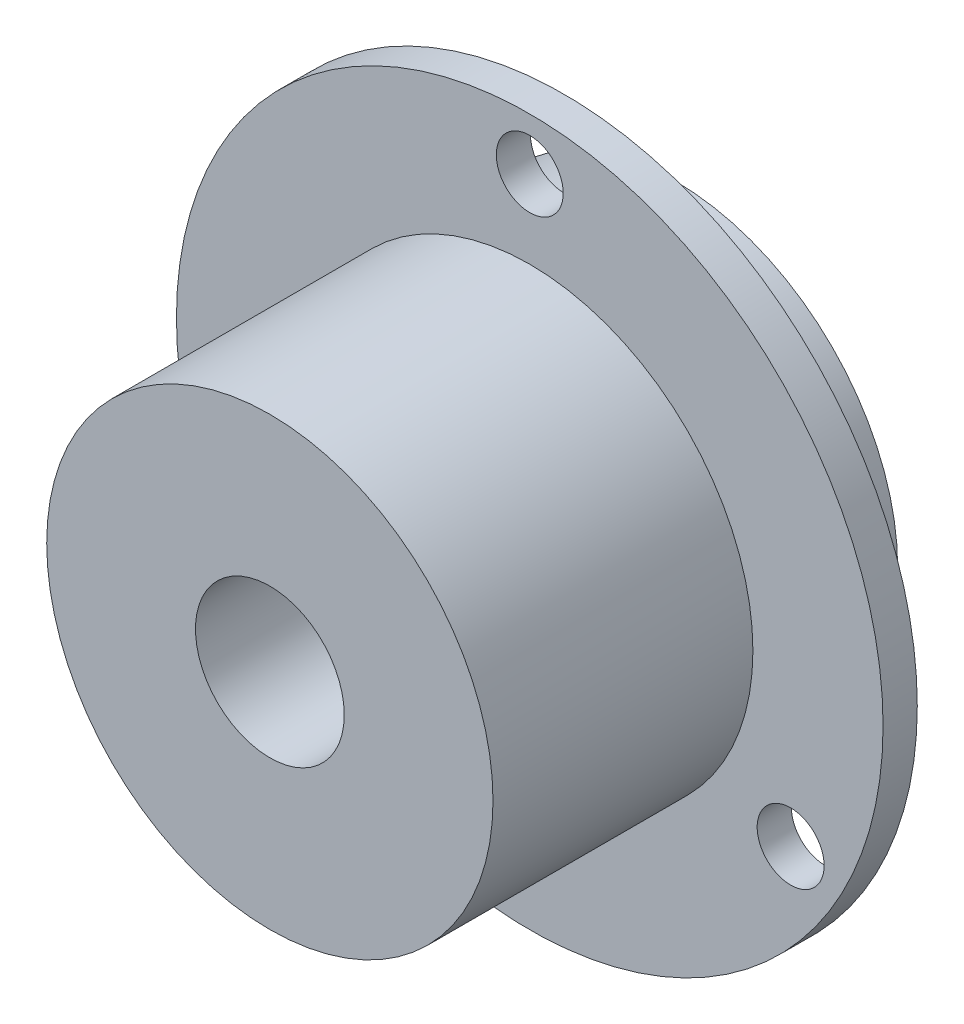
ISO-10303-21;
HEADER;
FILE_DESCRIPTION(('STEP AP214'),'2;1');
FILE_NAME('part.step','',(''),(''),'','','');
FILE_SCHEMA(('AUTOMOTIVE_DESIGN { 1 0 10303 214 1 1 1 1 }'));
ENDSEC;
DATA;
#1=APPLICATION_CONTEXT('core data for automotive mechanical design processes');
#2=APPLICATION_PROTOCOL_DEFINITION('international standard','automotive_design',2000,#1);
#3=PRODUCT_CONTEXT('',#1,'mechanical');
#4=PRODUCT('Part','Part','',(#3));
#5=PRODUCT_RELATED_PRODUCT_CATEGORY('part','',(#4));
#6=PRODUCT_DEFINITION_FORMATION('','',#4);
#7=PRODUCT_DEFINITION_CONTEXT('part definition',#1,'design');
#8=PRODUCT_DEFINITION('design','',#6,#7);
#9=PRODUCT_DEFINITION_SHAPE('','',#8);
#10=(LENGTH_UNIT() NAMED_UNIT(*) SI_UNIT(.MILLI.,.METRE.));
#11=(NAMED_UNIT(*) PLANE_ANGLE_UNIT() SI_UNIT($,.RADIAN.));
#12=(NAMED_UNIT(*) SI_UNIT($,.STERADIAN.) SOLID_ANGLE_UNIT());
#13=UNCERTAINTY_MEASURE_WITH_UNIT(LENGTH_MEASURE(1.E-05),#10,'distance_accuracy_value','');
#14=(GEOMETRIC_REPRESENTATION_CONTEXT(3) GLOBAL_UNCERTAINTY_ASSIGNED_CONTEXT((#13)) GLOBAL_UNIT_ASSIGNED_CONTEXT((#10,
#11,#12)) REPRESENTATION_CONTEXT('',''));
#15=CARTESIAN_POINT('',(0.,0.,0.));
#16=DIRECTION('',(0.,0.,1.));
#17=DIRECTION('',(1.,0.,0.));
#18=AXIS2_PLACEMENT_3D('',#15,#16,#17);
#19=CARTESIAN_POINT('',(15.,0.,17.47));
#20=DIRECTION('',(0.,0.,1.));
#21=DIRECTION('',(1.,0.,0.));
#22=AXIS2_PLACEMENT_3D('',#19,#20,#21);
#23=PLANE('',#22);
#24=CARTESIAN_POINT('',(0.,0.,17.47));
#25=DIRECTION('',(0.,0.,1.));
#26=DIRECTION('',(1.,0.,0.));
#27=AXIS2_PLACEMENT_3D('',#24,#25,#26);
#28=CIRCLE('',#27,15.);
#29=CARTESIAN_POINT('',(15.,0.,17.47));
#30=VERTEX_POINT('',#29);
#31=EDGE_CURVE('E66',#30,#30,#28,.T.);
#32=ORIENTED_EDGE('',*,*,#31,.T.);
#33=EDGE_LOOP('',(#32));
#34=FACE_BOUND('',#33,.T.);
#35=CARTESIAN_POINT('',(0.,0.,17.47));
#36=DIRECTION('',(0.,0.,1.));
#37=DIRECTION('',(1.,0.,0.));
#38=AXIS2_PLACEMENT_3D('',#35,#36,#37);
#39=CIRCLE('',#38,4.99999999999999);
#40=CARTESIAN_POINT('',(5.,0.,17.47));
#41=VERTEX_POINT('',#40);
#42=EDGE_CURVE('E10',#41,#41,#39,.T.);
#43=ORIENTED_EDGE('',*,*,#42,.F.);
#44=EDGE_LOOP('',(#43));
#45=FACE_BOUND('',#44,.T.);
#46=ADVANCED_FACE('F32',(#34,#45),#23,.T.);
#47=CARTESIAN_POINT('',(0.,0.,39.2849557522124));
#48=DIRECTION('',(0.,0.,1.));
#49=DIRECTION('',(1.,0.,0.));
#50=AXIS2_PLACEMENT_3D('',#47,#48,#49);
#51=CYLINDRICAL_SURFACE('',#50,4.99999999999999);
#52=ORIENTED_EDGE('',*,*,#42,.T.);
#53=EDGE_LOOP('',(#52));
#54=FACE_BOUND('',#53,.T.);
#55=CARTESIAN_POINT('',(0.,0.,-9.73));
#56=DIRECTION('',(0.,0.,1.));
#57=DIRECTION('',(1.,0.,0.));
#58=AXIS2_PLACEMENT_3D('',#55,#56,#57);
#59=CIRCLE('',#58,4.99999999999999);
#60=CARTESIAN_POINT('',(5.,0.,-9.73));
#61=VERTEX_POINT('',#60);
#62=EDGE_CURVE('E39',#61,#61,#59,.T.);
#63=ORIENTED_EDGE('',*,*,#62,.F.);
#64=EDGE_LOOP('',(#63));
#65=FACE_BOUND('',#64,.T.);
#66=ADVANCED_FACE('F88',(#54,#65),#51,.F.);
#67=CARTESIAN_POINT('',(5.,0.,-9.73));
#68=DIRECTION('',(0.,0.,-1.));
#69=DIRECTION('',(-1.,0.,0.));
#70=AXIS2_PLACEMENT_3D('',#67,#68,#69);
#71=PLANE('',#70);
#72=ORIENTED_EDGE('',*,*,#62,.T.);
#73=EDGE_LOOP('',(#72));
#74=FACE_BOUND('',#73,.T.);
#75=CARTESIAN_POINT('',(0.,0.,-9.73));
#76=DIRECTION('',(0.,0.,1.));
#77=DIRECTION('',(1.,0.,0.));
#78=AXIS2_PLACEMENT_3D('',#75,#76,#77);
#79=CIRCLE('',#78,15.);
#80=CARTESIAN_POINT('',(15.,0.,-9.73));
#81=VERTEX_POINT('',#80);
#82=EDGE_CURVE('E44',#81,#81,#79,.T.);
#83=ORIENTED_EDGE('',*,*,#82,.F.);
#84=EDGE_LOOP('',(#83));
#85=FACE_BOUND('',#84,.T.);
#86=ADVANCED_FACE('F86',(#74,#85),#71,.T.);
#87=CARTESIAN_POINT('',(0.,0.,39.2849557522124));
#88=DIRECTION('',(0.,0.,1.));
#89=DIRECTION('',(1.,0.,0.));
#90=AXIS2_PLACEMENT_3D('',#87,#88,#89);
#91=CYLINDRICAL_SURFACE('',#90,15.);
#92=ORIENTED_EDGE('',*,*,#82,.T.);
#93=EDGE_LOOP('',(#92));
#94=FACE_BOUND('',#93,.T.);
#95=CARTESIAN_POINT('',(0.,0.,-2.3));
#96=DIRECTION('',(0.,0.,1.));
#97=DIRECTION('',(1.,0.,0.));
#98=AXIS2_PLACEMENT_3D('',#95,#96,#97);
#99=CIRCLE('',#98,15.);
#100=CARTESIAN_POINT('',(15.,0.,-2.3));
#101=VERTEX_POINT('',#100);
#102=EDGE_CURVE('E78',#101,#101,#99,.T.);
#103=ORIENTED_EDGE('',*,*,#102,.F.);
#104=EDGE_LOOP('',(#103));
#105=FACE_BOUND('',#104,.T.);
#106=ADVANCED_FACE('F83',(#94,#105),#91,.T.);
#107=CARTESIAN_POINT('',(15.,0.,-2.3));
#108=DIRECTION('',(0.,0.,-1.));
#109=DIRECTION('',(-1.,0.,0.));
#110=AXIS2_PLACEMENT_3D('',#107,#108,#109);
#111=PLANE('',#110);
#112=CARTESIAN_POINT('',(0.,20.25,-2.3));
#113=DIRECTION('',(0.,0.,-1.));
#114=DIRECTION('',(-1.,0.,0.));
#115=AXIS2_PLACEMENT_3D('',#112,#113,#114);
#116=CIRCLE('',#115,2.25);
#117=CARTESIAN_POINT('',(-2.25,20.25,-2.3));
#118=VERTEX_POINT('',#117);
#119=EDGE_CURVE('E63',#118,#118,#116,.T.);
#120=ORIENTED_EDGE('',*,*,#119,.F.);
#121=EDGE_LOOP('',(#120));
#122=FACE_BOUND('',#121,.T.);
#123=CARTESIAN_POINT('',(17.5370144266349,-10.125,-2.3));
#124=DIRECTION('',(0.,0.,-1.));
#125=DIRECTION('',(-1.,0.,0.));
#126=AXIS2_PLACEMENT_3D('',#123,#124,#125);
#127=CIRCLE('',#126,2.25);
#128=CARTESIAN_POINT('',(15.2870144266349,-10.125,-2.3));
#129=VERTEX_POINT('',#128);
#130=EDGE_CURVE('E53',#129,#129,#127,.T.);
#131=ORIENTED_EDGE('',*,*,#130,.F.);
#132=EDGE_LOOP('',(#131));
#133=FACE_BOUND('',#132,.T.);
#134=CARTESIAN_POINT('',(-17.5370144266349,-10.125,-2.3));
#135=DIRECTION('',(0.,0.,-1.));
#136=DIRECTION('',(-1.,0.,0.));
#137=AXIS2_PLACEMENT_3D('',#134,#135,#136);
#138=CIRCLE('',#137,2.25);
#139=CARTESIAN_POINT('',(-19.7870144266349,-10.125,-2.3));
#140=VERTEX_POINT('',#139);
#141=EDGE_CURVE('E50',#140,#140,#138,.T.);
#142=ORIENTED_EDGE('',*,*,#141,.F.);
#143=EDGE_LOOP('',(#142));
#144=FACE_BOUND('',#143,.T.);
#145=ORIENTED_EDGE('',*,*,#102,.T.);
#146=EDGE_LOOP('',(#145));
#147=FACE_BOUND('',#146,.T.);
#148=CARTESIAN_POINT('',(0.,0.,-2.3));
#149=DIRECTION('',(0.,0.,1.));
#150=DIRECTION('',(1.,0.,0.));
#151=AXIS2_PLACEMENT_3D('',#148,#149,#150);
#152=CIRCLE('',#151,23.75);
#153=CARTESIAN_POINT('',(23.75,0.,-2.3));
#154=VERTEX_POINT('',#153);
#155=EDGE_CURVE('E75',#154,#154,#152,.T.);
#156=ORIENTED_EDGE('',*,*,#155,.F.);
#157=EDGE_LOOP('',(#156));
#158=FACE_BOUND('',#157,.T.);
#159=ADVANCED_FACE('F95',(#122,#133,#144,#147,#158),#111,.T.);
#160=CARTESIAN_POINT('',(0.,0.,39.2849557522124));
#161=DIRECTION('',(0.,0.,1.));
#162=DIRECTION('',(1.,0.,0.));
#163=AXIS2_PLACEMENT_3D('',#160,#161,#162);
#164=CYLINDRICAL_SURFACE('',#163,23.75);
#165=ORIENTED_EDGE('',*,*,#155,.T.);
#166=EDGE_LOOP('',(#165));
#167=FACE_BOUND('',#166,.T.);
#168=CARTESIAN_POINT('',(0.,0.,0.));
#169=DIRECTION('',(0.,0.,1.));
#170=DIRECTION('',(1.,0.,0.));
#171=AXIS2_PLACEMENT_3D('',#168,#169,#170);
#172=CIRCLE('',#171,23.75);
#173=CARTESIAN_POINT('',(23.75,0.,0.));
#174=VERTEX_POINT('',#173);
#175=EDGE_CURVE('E72',#174,#174,#172,.T.);
#176=ORIENTED_EDGE('',*,*,#175,.F.);
#177=EDGE_LOOP('',(#176));
#178=FACE_BOUND('',#177,.T.);
#179=ADVANCED_FACE('F116',(#167,#178),#164,.T.);
#180=CARTESIAN_POINT('',(23.75,0.,0.));
#181=DIRECTION('',(0.,0.,1.));
#182=DIRECTION('',(1.,0.,0.));
#183=AXIS2_PLACEMENT_3D('',#180,#181,#182);
#184=PLANE('',#183);
#185=CARTESIAN_POINT('',(0.,20.25,0.));
#186=DIRECTION('',(0.,0.,1.));
#187=DIRECTION('',(1.,0.,0.));
#188=AXIS2_PLACEMENT_3D('',#185,#186,#187);
#189=CIRCLE('',#188,2.25);
#190=CARTESIAN_POINT('',(2.25,20.25,0.));
#191=VERTEX_POINT('',#190);
#192=EDGE_CURVE('E35',#191,#191,#189,.T.);
#193=ORIENTED_EDGE('',*,*,#192,.F.);
#194=EDGE_LOOP('',(#193));
#195=FACE_BOUND('',#194,.T.);
#196=CARTESIAN_POINT('',(17.5370144266349,-10.125,0.));
#197=DIRECTION('',(0.,0.,1.));
#198=DIRECTION('',(1.,0.,0.));
#199=AXIS2_PLACEMENT_3D('',#196,#197,#198);
#200=CIRCLE('',#199,2.25);
#201=CARTESIAN_POINT('',(19.7870144266349,-10.125,0.));
#202=VERTEX_POINT('',#201);
#203=EDGE_CURVE('E51',#202,#202,#200,.T.);
#204=ORIENTED_EDGE('',*,*,#203,.F.);
#205=EDGE_LOOP('',(#204));
#206=FACE_BOUND('',#205,.T.);
#207=CARTESIAN_POINT('',(-17.5370144266349,-10.125,0.));
#208=DIRECTION('',(0.,0.,1.));
#209=DIRECTION('',(1.,0.,0.));
#210=AXIS2_PLACEMENT_3D('',#207,#208,#209);
#211=CIRCLE('',#210,2.25);
#212=CARTESIAN_POINT('',(-15.2870144266349,-10.125,0.));
#213=VERTEX_POINT('',#212);
#214=EDGE_CURVE('E48',#213,#213,#211,.T.);
#215=ORIENTED_EDGE('',*,*,#214,.F.);
#216=EDGE_LOOP('',(#215));
#217=FACE_BOUND('',#216,.T.);
#218=ORIENTED_EDGE('',*,*,#175,.T.);
#219=EDGE_LOOP('',(#218));
#220=FACE_BOUND('',#219,.T.);
#221=CARTESIAN_POINT('',(0.,0.,0.));
#222=DIRECTION('',(0.,0.,1.));
#223=DIRECTION('',(1.,0.,0.));
#224=AXIS2_PLACEMENT_3D('',#221,#222,#223);
#225=CIRCLE('',#224,15.);
#226=CARTESIAN_POINT('',(15.,0.,0.));
#227=VERTEX_POINT('',#226);
#228=EDGE_CURVE('E69',#227,#227,#225,.T.);
#229=ORIENTED_EDGE('',*,*,#228,.F.);
#230=EDGE_LOOP('',(#229));
#231=FACE_BOUND('',#230,.T.);
#232=ADVANCED_FACE('F107',(#195,#206,#217,#220,#231),#184,.T.);
#233=CARTESIAN_POINT('',(0.,0.,39.2849557522124));
#234=DIRECTION('',(0.,0.,1.));
#235=DIRECTION('',(1.,0.,0.));
#236=AXIS2_PLACEMENT_3D('',#233,#234,#235);
#237=CYLINDRICAL_SURFACE('',#236,15.);
#238=ORIENTED_EDGE('',*,*,#228,.T.);
#239=EDGE_LOOP('',(#238));
#240=FACE_BOUND('',#239,.T.);
#241=ORIENTED_EDGE('',*,*,#31,.F.);
#242=EDGE_LOOP('',(#241));
#243=FACE_BOUND('',#242,.T.);
#244=ADVANCED_FACE('F104',(#240,#243),#237,.T.);
#245=CARTESIAN_POINT('',(-17.5370144266349,-10.125,-5.));
#246=DIRECTION('',(0.,0.,1.));
#247=DIRECTION('',(1.,0.,0.));
#248=AXIS2_PLACEMENT_3D('',#245,#246,#247);
#249=CYLINDRICAL_SURFACE('',#248,2.25);
#250=ORIENTED_EDGE('',*,*,#141,.T.);
#251=EDGE_LOOP('',(#250));
#252=FACE_BOUND('',#251,.T.);
#253=ORIENTED_EDGE('',*,*,#214,.T.);
#254=EDGE_LOOP('',(#253));
#255=FACE_BOUND('',#254,.T.);
#256=ADVANCED_FACE('F106',(#252,#255),#249,.F.);
#257=CARTESIAN_POINT('',(17.5370144266349,-10.125,-5.));
#258=DIRECTION('',(0.,0.,1.));
#259=DIRECTION('',(1.,0.,0.));
#260=AXIS2_PLACEMENT_3D('',#257,#258,#259);
#261=CYLINDRICAL_SURFACE('',#260,2.25);
#262=ORIENTED_EDGE('',*,*,#130,.T.);
#263=EDGE_LOOP('',(#262));
#264=FACE_BOUND('',#263,.T.);
#265=ORIENTED_EDGE('',*,*,#203,.T.);
#266=EDGE_LOOP('',(#265));
#267=FACE_BOUND('',#266,.T.);
#268=ADVANCED_FACE('F114',(#264,#267),#261,.F.);
#269=CARTESIAN_POINT('',(0.,20.25,-5.));
#270=DIRECTION('',(0.,0.,1.));
#271=DIRECTION('',(1.,0.,0.));
#272=AXIS2_PLACEMENT_3D('',#269,#270,#271);
#273=CYLINDRICAL_SURFACE('',#272,2.25);
#274=ORIENTED_EDGE('',*,*,#119,.T.);
#275=EDGE_LOOP('',(#274));
#276=FACE_BOUND('',#275,.T.);
#277=ORIENTED_EDGE('',*,*,#192,.T.);
#278=EDGE_LOOP('',(#277));
#279=FACE_BOUND('',#278,.T.);
#280=ADVANCED_FACE('F143',(#276,#279),#273,.F.);
#281=CLOSED_SHELL('',(#46,#66,#86,#106,#159,#179,#232,#244,#256,#268,#280));
#282=MANIFOLD_SOLID_BREP('B2',#281);
#283=ADVANCED_BREP_SHAPE_REPRESENTATION('',(#18,#282),#14);
#284=SHAPE_DEFINITION_REPRESENTATION(#9,#283);
ENDSEC;
END-ISO-10303-21;
